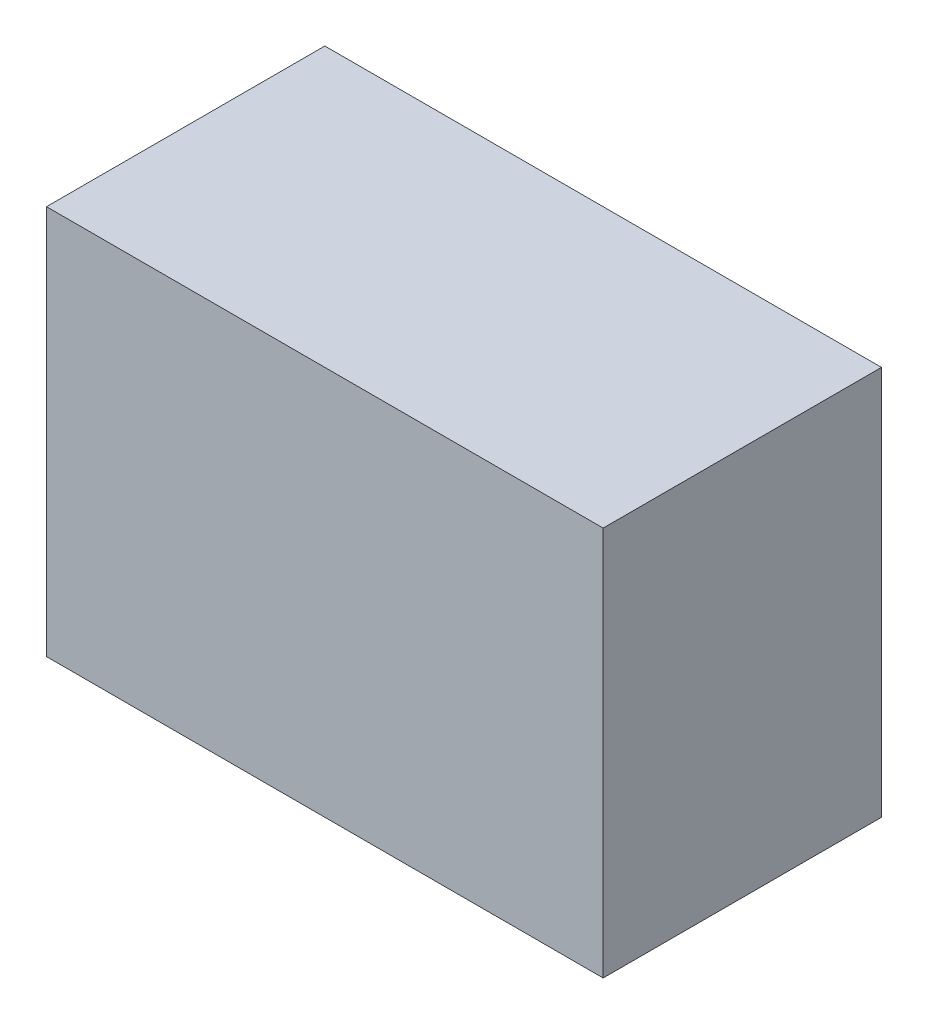
ISO-10303-21;
HEADER;
FILE_DESCRIPTION(('STEP AP214'),'2;1');
FILE_NAME('part.step','',(''),(''),'','','');
FILE_SCHEMA(('AUTOMOTIVE_DESIGN { 1 0 10303 214 1 1 1 1 }'));
ENDSEC;
DATA;
#1=APPLICATION_CONTEXT('core data for automotive mechanical design processes');
#2=APPLICATION_PROTOCOL_DEFINITION('international standard','automotive_design',2000,#1);
#3=PRODUCT_CONTEXT('',#1,'mechanical');
#4=PRODUCT('Part','Part','',(#3));
#5=PRODUCT_RELATED_PRODUCT_CATEGORY('part','',(#4));
#6=PRODUCT_DEFINITION_FORMATION('','',#4);
#7=PRODUCT_DEFINITION_CONTEXT('part definition',#1,'design');
#8=PRODUCT_DEFINITION('design','',#6,#7);
#9=PRODUCT_DEFINITION_SHAPE('','',#8);
#10=(LENGTH_UNIT() NAMED_UNIT(*) SI_UNIT(.MILLI.,.METRE.));
#11=(NAMED_UNIT(*) PLANE_ANGLE_UNIT() SI_UNIT($,.RADIAN.));
#12=(NAMED_UNIT(*) SI_UNIT($,.STERADIAN.) SOLID_ANGLE_UNIT());
#13=UNCERTAINTY_MEASURE_WITH_UNIT(LENGTH_MEASURE(1.E-05),#10,'distance_accuracy_value','');
#14=(GEOMETRIC_REPRESENTATION_CONTEXT(3) GLOBAL_UNCERTAINTY_ASSIGNED_CONTEXT((#13)) GLOBAL_UNIT_ASSIGNED_CONTEXT((#10,
#11,#12)) REPRESENTATION_CONTEXT('',''));
#15=CARTESIAN_POINT('',(0.,0.,0.));
#16=DIRECTION('',(0.,0.,1.));
#17=DIRECTION('',(1.,0.,0.));
#18=AXIS2_PLACEMENT_3D('',#15,#16,#17);
#19=CARTESIAN_POINT('',(500.,350.,500.));
#20=DIRECTION('',(-1.,0.,0.));
#21=DIRECTION('',(0.,0.,1.));
#22=AXIS2_PLACEMENT_3D('',#19,#20,#21);
#23=PLANE('',#22);
#24=DIRECTION('',(0.,1.,0.));
#25=VECTOR('',#24,1.);
#26=CARTESIAN_POINT('',(500.,350.,0.));
#27=LINE('',#26,#25);
#28=CARTESIAN_POINT('',(500.,-350.,0.));
#29=VERTEX_POINT('',#28);
#30=CARTESIAN_POINT('',(500.,350.,0.));
#31=VERTEX_POINT('',#30);
#32=EDGE_CURVE('E127',#29,#31,#27,.T.);
#33=ORIENTED_EDGE('',*,*,#32,.T.);
#34=DIRECTION('',(0.,0.,-1.));
#35=VECTOR('',#34,1.);
#36=CARTESIAN_POINT('',(500.,350.,500.));
#37=LINE('',#36,#35);
#38=CARTESIAN_POINT('',(500.,350.,500.));
#39=VERTEX_POINT('',#38);
#40=EDGE_CURVE('E11',#39,#31,#37,.T.);
#41=ORIENTED_EDGE('',*,*,#40,.F.);
#42=DIRECTION('',(0.,1.,0.));
#43=VECTOR('',#42,1.);
#44=CARTESIAN_POINT('',(500.,350.,500.));
#45=LINE('',#44,#43);
#46=CARTESIAN_POINT('',(500.,-350.,500.));
#47=VERTEX_POINT('',#46);
#48=EDGE_CURVE('E147',#47,#39,#45,.T.);
#49=ORIENTED_EDGE('',*,*,#48,.F.);
#50=DIRECTION('',(0.,0.,-1.));
#51=VECTOR('',#50,1.);
#52=CARTESIAN_POINT('',(500.,-350.,500.));
#53=LINE('',#52,#51);
#54=EDGE_CURVE('E152',#47,#29,#53,.T.);
#55=ORIENTED_EDGE('',*,*,#54,.T.);
#56=EDGE_LOOP('',(#33,#41,#49,#55));
#57=FACE_BOUND('',#56,.T.);
#58=ADVANCED_FACE('F31',(#57),#23,.F.);
#59=CARTESIAN_POINT('',(-500.,350.,500.));
#60=DIRECTION('',(0.,-1.,0.));
#61=DIRECTION('',(0.,0.,-1.));
#62=AXIS2_PLACEMENT_3D('',#59,#60,#61);
#63=PLANE('',#62);
#64=DIRECTION('',(-1.,0.,0.));
#65=VECTOR('',#64,1.);
#66=CARTESIAN_POINT('',(-500.,350.,0.));
#67=LINE('',#66,#65);
#68=CARTESIAN_POINT('',(-500.,350.,0.));
#69=VERTEX_POINT('',#68);
#70=EDGE_CURVE('E131',#31,#69,#67,.T.);
#71=ORIENTED_EDGE('',*,*,#70,.T.);
#72=DIRECTION('',(0.,0.,-1.));
#73=VECTOR('',#72,1.);
#74=CARTESIAN_POINT('',(-500.,350.,500.));
#75=LINE('',#74,#73);
#76=CARTESIAN_POINT('',(-500.,350.,500.));
#77=VERTEX_POINT('',#76);
#78=EDGE_CURVE('E38',#77,#69,#75,.T.);
#79=ORIENTED_EDGE('',*,*,#78,.F.);
#80=DIRECTION('',(-1.,0.,0.));
#81=VECTOR('',#80,1.);
#82=CARTESIAN_POINT('',(-500.,350.,500.));
#83=LINE('',#82,#81);
#84=EDGE_CURVE('E82',#39,#77,#83,.T.);
#85=ORIENTED_EDGE('',*,*,#84,.F.);
#86=ORIENTED_EDGE('',*,*,#40,.T.);
#87=EDGE_LOOP('',(#71,#79,#85,#86));
#88=FACE_BOUND('',#87,.T.);
#89=ADVANCED_FACE('F181',(#88),#63,.F.);
#90=CARTESIAN_POINT('',(-500.,350.,500.));
#91=DIRECTION('',(1.,0.,0.));
#92=DIRECTION('',(0.,1.,0.));
#93=AXIS2_PLACEMENT_3D('',#90,#91,#92);
#94=PLANE('',#93);
#95=DIRECTION('',(0.,-1.,0.));
#96=VECTOR('',#95,1.);
#97=CARTESIAN_POINT('',(-500.,350.,0.));
#98=LINE('',#97,#96);
#99=CARTESIAN_POINT('',(-500.,-350.,0.));
#100=VERTEX_POINT('',#99);
#101=EDGE_CURVE('E155',#69,#100,#98,.T.);
#102=ORIENTED_EDGE('',*,*,#101,.T.);
#103=DIRECTION('',(0.,0.,-1.));
#104=VECTOR('',#103,1.);
#105=CARTESIAN_POINT('',(-500.,-350.,500.));
#106=LINE('',#105,#104);
#107=CARTESIAN_POINT('',(-500.,-350.,500.));
#108=VERTEX_POINT('',#107);
#109=EDGE_CURVE('E159',#108,#100,#106,.T.);
#110=ORIENTED_EDGE('',*,*,#109,.F.);
#111=DIRECTION('',(0.,-1.,0.));
#112=VECTOR('',#111,1.);
#113=CARTESIAN_POINT('',(-500.,350.,500.));
#114=LINE('',#113,#112);
#115=EDGE_CURVE('E150',#77,#108,#114,.T.);
#116=ORIENTED_EDGE('',*,*,#115,.F.);
#117=ORIENTED_EDGE('',*,*,#78,.T.);
#118=EDGE_LOOP('',(#102,#110,#116,#117));
#119=FACE_BOUND('',#118,.T.);
#120=ADVANCED_FACE('F164',(#119),#94,.F.);
#121=CARTESIAN_POINT('',(-500.,-350.,500.));
#122=DIRECTION('',(0.,1.,0.));
#123=DIRECTION('',(0.,0.,1.));
#124=AXIS2_PLACEMENT_3D('',#121,#122,#123);
#125=PLANE('',#124);
#126=DIRECTION('',(1.,0.,0.));
#127=VECTOR('',#126,1.);
#128=CARTESIAN_POINT('',(-500.,-350.,0.));
#129=LINE('',#128,#127);
#130=EDGE_CURVE('E75',#100,#29,#129,.T.);
#131=ORIENTED_EDGE('',*,*,#130,.T.);
#132=ORIENTED_EDGE('',*,*,#54,.F.);
#133=DIRECTION('',(1.,0.,0.));
#134=VECTOR('',#133,1.);
#135=CARTESIAN_POINT('',(-500.,-350.,500.));
#136=LINE('',#135,#134);
#137=EDGE_CURVE('E54',#108,#47,#136,.T.);
#138=ORIENTED_EDGE('',*,*,#137,.F.);
#139=ORIENTED_EDGE('',*,*,#109,.T.);
#140=EDGE_LOOP('',(#131,#132,#138,#139));
#141=FACE_BOUND('',#140,.T.);
#142=ADVANCED_FACE('F172',(#141),#125,.F.);
#143=CARTESIAN_POINT('',(500.,-350.,500.));
#144=DIRECTION('',(0.,0.,1.));
#145=DIRECTION('',(1.,0.,0.));
#146=AXIS2_PLACEMENT_3D('',#143,#144,#145);
#147=PLANE('',#146);
#148=ORIENTED_EDGE('',*,*,#48,.T.);
#149=ORIENTED_EDGE('',*,*,#84,.T.);
#150=ORIENTED_EDGE('',*,*,#115,.T.);
#151=ORIENTED_EDGE('',*,*,#137,.T.);
#152=EDGE_LOOP('',(#148,#149,#150,#151));
#153=FACE_BOUND('',#152,.T.);
#154=ADVANCED_FACE('F174',(#153),#147,.T.);
#155=CARTESIAN_POINT('',(500.,-350.,0.));
#156=DIRECTION('',(0.,0.,1.));
#157=DIRECTION('',(1.,0.,0.));
#158=AXIS2_PLACEMENT_3D('',#155,#156,#157);
#159=PLANE('',#158);
#160=DIRECTION('',(1.,0.,0.));
#161=VECTOR('',#160,1.);
#162=CARTESIAN_POINT('',(-500.,-347.,0.));
#163=LINE('',#162,#161);
#164=CARTESIAN_POINT('',(-497.,-347.,0.));
#165=VERTEX_POINT('',#164);
#166=CARTESIAN_POINT('',(497.,-347.,0.));
#167=VERTEX_POINT('',#166);
#168=EDGE_CURVE('E122',#165,#167,#163,.T.);
#169=ORIENTED_EDGE('',*,*,#168,.T.);
#170=DIRECTION('',(0.,1.,0.));
#171=VECTOR('',#170,1.);
#172=CARTESIAN_POINT('',(497.,350.,0.));
#173=LINE('',#172,#171);
#174=CARTESIAN_POINT('',(497.,347.,0.));
#175=VERTEX_POINT('',#174);
#176=EDGE_CURVE('E141',#167,#175,#173,.T.);
#177=ORIENTED_EDGE('',*,*,#176,.T.);
#178=DIRECTION('',(-1.,0.,0.));
#179=VECTOR('',#178,1.);
#180=CARTESIAN_POINT('',(-500.,347.,0.));
#181=LINE('',#180,#179);
#182=CARTESIAN_POINT('',(-497.,347.,0.));
#183=VERTEX_POINT('',#182);
#184=EDGE_CURVE('E126',#175,#183,#181,.T.);
#185=ORIENTED_EDGE('',*,*,#184,.T.);
#186=DIRECTION('',(0.,-1.,0.));
#187=VECTOR('',#186,1.);
#188=CARTESIAN_POINT('',(-497.,350.,0.));
#189=LINE('',#188,#187);
#190=EDGE_CURVE('E45',#183,#165,#189,.T.);
#191=ORIENTED_EDGE('',*,*,#190,.T.);
#192=EDGE_LOOP('',(#169,#177,#185,#191));
#193=FACE_BOUND('',#192,.T.);
#194=ORIENTED_EDGE('',*,*,#32,.F.);
#195=ORIENTED_EDGE('',*,*,#130,.F.);
#196=ORIENTED_EDGE('',*,*,#101,.F.);
#197=ORIENTED_EDGE('',*,*,#70,.F.);
#198=EDGE_LOOP('',(#194,#195,#196,#197));
#199=FACE_BOUND('',#198,.T.);
#200=ADVANCED_FACE('F168',(#193,#199),#159,.F.);
#201=CARTESIAN_POINT('',(497.,350.,500.));
#202=DIRECTION('',(-1.,0.,0.));
#203=DIRECTION('',(0.,0.,1.));
#204=AXIS2_PLACEMENT_3D('',#201,#202,#203);
#205=PLANE('',#204);
#206=ORIENTED_EDGE('',*,*,#176,.F.);
#207=DIRECTION('',(0.,0.,-1.));
#208=VECTOR('',#207,1.);
#209=CARTESIAN_POINT('',(497.,-347.,500.));
#210=LINE('',#209,#208);
#211=CARTESIAN_POINT('',(497.,-347.,497.));
#212=VERTEX_POINT('',#211);
#213=EDGE_CURVE('E121',#212,#167,#210,.T.);
#214=ORIENTED_EDGE('',*,*,#213,.F.);
#215=DIRECTION('',(0.,1.,0.));
#216=VECTOR('',#215,1.);
#217=CARTESIAN_POINT('',(497.,350.,497.));
#218=LINE('',#217,#216);
#219=CARTESIAN_POINT('',(497.,347.,497.));
#220=VERTEX_POINT('',#219);
#221=EDGE_CURVE('E109',#212,#220,#218,.T.);
#222=ORIENTED_EDGE('',*,*,#221,.T.);
#223=DIRECTION('',(0.,0.,-1.));
#224=VECTOR('',#223,1.);
#225=CARTESIAN_POINT('',(497.,347.,500.));
#226=LINE('',#225,#224);
#227=EDGE_CURVE('E119',#220,#175,#226,.T.);
#228=ORIENTED_EDGE('',*,*,#227,.T.);
#229=EDGE_LOOP('',(#206,#214,#222,#228));
#230=FACE_BOUND('',#229,.T.);
#231=ADVANCED_FACE('F118',(#230),#205,.T.);
#232=CARTESIAN_POINT('',(-500.,347.,500.));
#233=DIRECTION('',(0.,-1.,0.));
#234=DIRECTION('',(0.,0.,-1.));
#235=AXIS2_PLACEMENT_3D('',#232,#233,#234);
#236=PLANE('',#235);
#237=ORIENTED_EDGE('',*,*,#184,.F.);
#238=ORIENTED_EDGE('',*,*,#227,.F.);
#239=DIRECTION('',(-1.,0.,0.));
#240=VECTOR('',#239,1.);
#241=CARTESIAN_POINT('',(-500.,347.,497.));
#242=LINE('',#241,#240);
#243=CARTESIAN_POINT('',(-497.,347.,497.));
#244=VERTEX_POINT('',#243);
#245=EDGE_CURVE('E105',#220,#244,#242,.T.);
#246=ORIENTED_EDGE('',*,*,#245,.T.);
#247=DIRECTION('',(0.,0.,-1.));
#248=VECTOR('',#247,1.);
#249=CARTESIAN_POINT('',(-497.,347.,500.));
#250=LINE('',#249,#248);
#251=EDGE_CURVE('E128',#244,#183,#250,.T.);
#252=ORIENTED_EDGE('',*,*,#251,.T.);
#253=EDGE_LOOP('',(#237,#238,#246,#252));
#254=FACE_BOUND('',#253,.T.);
#255=ADVANCED_FACE('F124',(#254),#236,.T.);
#256=CARTESIAN_POINT('',(-497.,350.,500.));
#257=DIRECTION('',(1.,0.,0.));
#258=DIRECTION('',(0.,1.,0.));
#259=AXIS2_PLACEMENT_3D('',#256,#257,#258);
#260=PLANE('',#259);
#261=ORIENTED_EDGE('',*,*,#190,.F.);
#262=ORIENTED_EDGE('',*,*,#251,.F.);
#263=DIRECTION('',(0.,-1.,0.));
#264=VECTOR('',#263,1.);
#265=CARTESIAN_POINT('',(-497.,350.,497.));
#266=LINE('',#265,#264);
#267=CARTESIAN_POINT('',(-497.,-347.,497.));
#268=VERTEX_POINT('',#267);
#269=EDGE_CURVE('E110',#244,#268,#266,.T.);
#270=ORIENTED_EDGE('',*,*,#269,.T.);
#271=DIRECTION('',(0.,0.,-1.));
#272=VECTOR('',#271,1.);
#273=CARTESIAN_POINT('',(-497.,-347.,500.));
#274=LINE('',#273,#272);
#275=EDGE_CURVE('E133',#268,#165,#274,.T.);
#276=ORIENTED_EDGE('',*,*,#275,.T.);
#277=EDGE_LOOP('',(#261,#262,#270,#276));
#278=FACE_BOUND('',#277,.T.);
#279=ADVANCED_FACE('F229',(#278),#260,.T.);
#280=CARTESIAN_POINT('',(-500.,-347.,500.));
#281=DIRECTION('',(0.,1.,0.));
#282=DIRECTION('',(0.,0.,1.));
#283=AXIS2_PLACEMENT_3D('',#280,#281,#282);
#284=PLANE('',#283);
#285=ORIENTED_EDGE('',*,*,#168,.F.);
#286=ORIENTED_EDGE('',*,*,#275,.F.);
#287=DIRECTION('',(1.,0.,0.));
#288=VECTOR('',#287,1.);
#289=CARTESIAN_POINT('',(-500.,-347.,497.));
#290=LINE('',#289,#288);
#291=EDGE_CURVE('E136',#268,#212,#290,.T.);
#292=ORIENTED_EDGE('',*,*,#291,.T.);
#293=ORIENTED_EDGE('',*,*,#213,.T.);
#294=EDGE_LOOP('',(#285,#286,#292,#293));
#295=FACE_BOUND('',#294,.T.);
#296=ADVANCED_FACE('F238',(#295),#284,.T.);
#297=CARTESIAN_POINT('',(500.,-350.,497.));
#298=DIRECTION('',(0.,0.,1.));
#299=DIRECTION('',(1.,0.,0.));
#300=AXIS2_PLACEMENT_3D('',#297,#298,#299);
#301=PLANE('',#300);
#302=ORIENTED_EDGE('',*,*,#221,.F.);
#303=ORIENTED_EDGE('',*,*,#291,.F.);
#304=ORIENTED_EDGE('',*,*,#269,.F.);
#305=ORIENTED_EDGE('',*,*,#245,.F.);
#306=EDGE_LOOP('',(#302,#303,#304,#305));
#307=FACE_BOUND('',#306,.T.);
#308=ADVANCED_FACE('F107',(#307),#301,.F.);
#309=CLOSED_SHELL('',(#58,#89,#120,#142,#154,#200,#231,#255,#279,#296,#308));
#310=MANIFOLD_SOLID_BREP('B2',#309);
#311=ADVANCED_BREP_SHAPE_REPRESENTATION('',(#18,#310),#14);
#312=SHAPE_DEFINITION_REPRESENTATION(#9,#311);
ENDSEC;
END-ISO-10303-21;
